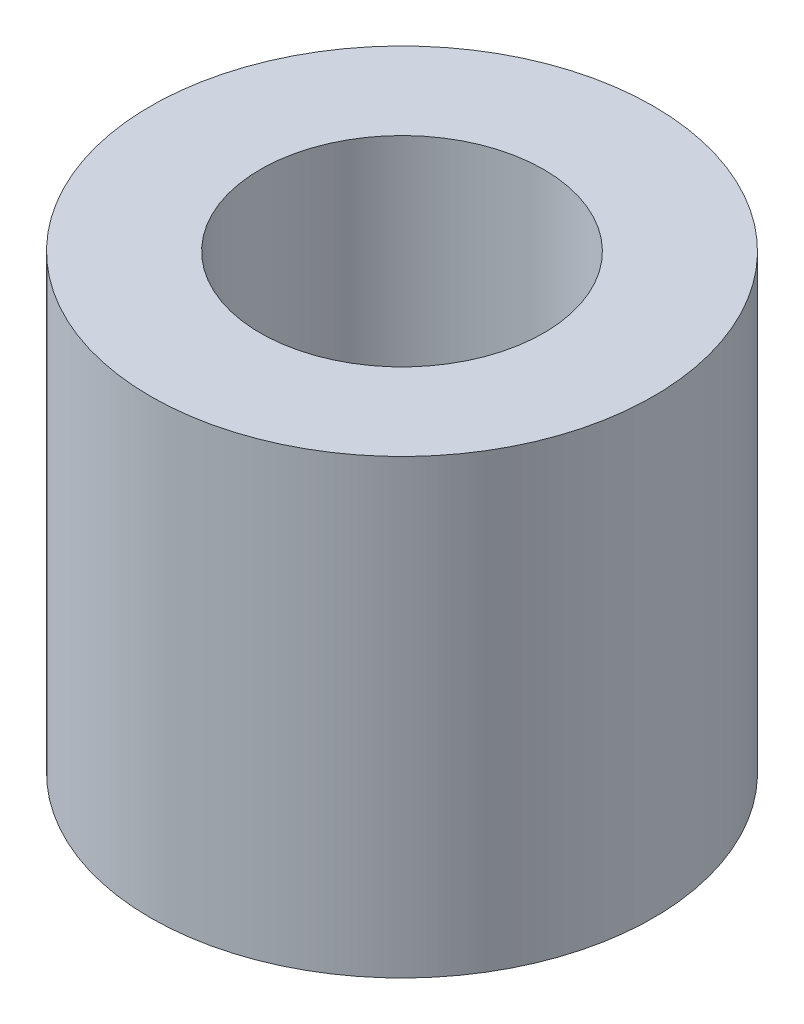
ISO-10303-21;
HEADER;
FILE_DESCRIPTION(('STEP AP214'),'2;1');
FILE_NAME('part.step','',(''),(''),'','','');
FILE_SCHEMA(('AUTOMOTIVE_DESIGN { 1 0 10303 214 1 1 1 1 }'));
ENDSEC;
DATA;
#1=APPLICATION_CONTEXT('core data for automotive mechanical design processes');
#2=APPLICATION_PROTOCOL_DEFINITION('international standard','automotive_design',2000,#1);
#3=PRODUCT_CONTEXT('',#1,'mechanical');
#4=PRODUCT('Part','Part','',(#3));
#5=PRODUCT_RELATED_PRODUCT_CATEGORY('part','',(#4));
#6=PRODUCT_DEFINITION_FORMATION('','',#4);
#7=PRODUCT_DEFINITION_CONTEXT('part definition',#1,'design');
#8=PRODUCT_DEFINITION('design','',#6,#7);
#9=PRODUCT_DEFINITION_SHAPE('','',#8);
#10=(LENGTH_UNIT() NAMED_UNIT(*) SI_UNIT(.MILLI.,.METRE.));
#11=(NAMED_UNIT(*) PLANE_ANGLE_UNIT() SI_UNIT($,.RADIAN.));
#12=(NAMED_UNIT(*) SI_UNIT($,.STERADIAN.) SOLID_ANGLE_UNIT());
#13=UNCERTAINTY_MEASURE_WITH_UNIT(LENGTH_MEASURE(1.E-05),#10,'distance_accuracy_value','');
#14=(GEOMETRIC_REPRESENTATION_CONTEXT(3) GLOBAL_UNCERTAINTY_ASSIGNED_CONTEXT((#13)) GLOBAL_UNIT_ASSIGNED_CONTEXT((#10,
#11,#12)) REPRESENTATION_CONTEXT('',''));
#15=CARTESIAN_POINT('',(0.,0.,0.));
#16=DIRECTION('',(0.,0.,1.));
#17=DIRECTION('',(1.,0.,0.));
#18=AXIS2_PLACEMENT_3D('',#15,#16,#17);
#19=CARTESIAN_POINT('',(0.,0.,0.));
#20=DIRECTION('',(0.,-1.,0.));
#21=DIRECTION('',(0.,0.,-1.));
#22=AXIS2_PLACEMENT_3D('',#19,#20,#21);
#23=CYLINDRICAL_SURFACE('',#22,3.175);
#24=CARTESIAN_POINT('',(0.,7.3914,0.));
#25=DIRECTION('',(0.,-1.,0.));
#26=DIRECTION('',(0.,0.,-1.));
#27=AXIS2_PLACEMENT_3D('',#24,#25,#26);
#28=CIRCLE('',#27,3.175);
#29=CARTESIAN_POINT('',(0.,7.3914,-3.175));
#30=VERTEX_POINT('',#29);
#31=EDGE_CURVE('E64',#30,#30,#28,.T.);
#32=ORIENTED_EDGE('',*,*,#31,.F.);
#33=EDGE_LOOP('',(#32));
#34=FACE_BOUND('',#33,.T.);
#35=CARTESIAN_POINT('',(0.,0.,0.));
#36=DIRECTION('',(0.,-1.,0.));
#37=DIRECTION('',(0.,0.,-1.));
#38=AXIS2_PLACEMENT_3D('',#35,#36,#37);
#39=CIRCLE('',#38,3.175);
#40=CARTESIAN_POINT('',(0.,0.,-3.175));
#41=VERTEX_POINT('',#40);
#42=EDGE_CURVE('E10',#41,#41,#39,.T.);
#43=ORIENTED_EDGE('',*,*,#42,.T.);
#44=EDGE_LOOP('',(#43));
#45=FACE_BOUND('',#44,.T.);
#46=ADVANCED_FACE('F37',(#34,#45),#23,.F.);
#47=CARTESIAN_POINT('',(-3.175,0.,0.));
#48=DIRECTION('',(0.,1.,0.));
#49=DIRECTION('',(0.,0.,1.));
#50=AXIS2_PLACEMENT_3D('',#47,#48,#49);
#51=PLANE('',#50);
#52=ORIENTED_EDGE('',*,*,#42,.F.);
#53=EDGE_LOOP('',(#52));
#54=FACE_BOUND('',#53,.T.);
#55=CARTESIAN_POINT('',(0.,0.,0.));
#56=DIRECTION('',(0.,-1.,0.));
#57=DIRECTION('',(0.,0.,-1.));
#58=AXIS2_PLACEMENT_3D('',#55,#56,#57);
#59=CIRCLE('',#58,20.7264);
#60=CARTESIAN_POINT('',(0.,0.,-20.7264));
#61=VERTEX_POINT('',#60);
#62=EDGE_CURVE('E44',#61,#61,#59,.T.);
#63=ORIENTED_EDGE('',*,*,#62,.T.);
#64=EDGE_LOOP('',(#63));
#65=FACE_BOUND('',#64,.T.);
#66=ADVANCED_FACE('F72',(#54,#65),#51,.F.);
#67=CARTESIAN_POINT('',(0.,0.,0.));
#68=DIRECTION('',(0.,-1.,0.));
#69=DIRECTION('',(0.,0.,-1.));
#70=AXIS2_PLACEMENT_3D('',#67,#68,#69);
#71=CYLINDRICAL_SURFACE('',#70,20.7264);
#72=ORIENTED_EDGE('',*,*,#62,.F.);
#73=EDGE_LOOP('',(#72));
#74=FACE_BOUND('',#73,.T.);
#75=CARTESIAN_POINT('',(0.,37.2364,0.));
#76=DIRECTION('',(0.,-1.,0.));
#77=DIRECTION('',(0.,0.,-1.));
#78=AXIS2_PLACEMENT_3D('',#75,#76,#77);
#79=CIRCLE('',#78,20.7264);
#80=CARTESIAN_POINT('',(0.,37.2364,-20.7264));
#81=VERTEX_POINT('',#80);
#82=EDGE_CURVE('E49',#81,#81,#79,.T.);
#83=ORIENTED_EDGE('',*,*,#82,.T.);
#84=EDGE_LOOP('',(#83));
#85=FACE_BOUND('',#84,.T.);
#86=ADVANCED_FACE('F76',(#74,#85),#71,.T.);
#87=CARTESIAN_POINT('',(-20.7264,37.2364,0.));
#88=DIRECTION('',(0.,-1.,0.));
#89=DIRECTION('',(0.,0.,-1.));
#90=AXIS2_PLACEMENT_3D('',#87,#88,#89);
#91=PLANE('',#90);
#92=ORIENTED_EDGE('',*,*,#82,.F.);
#93=EDGE_LOOP('',(#92));
#94=FACE_BOUND('',#93,.T.);
#95=CARTESIAN_POINT('',(0.,37.2364,0.));
#96=DIRECTION('',(0.,-1.,0.));
#97=DIRECTION('',(0.,0.,-1.));
#98=AXIS2_PLACEMENT_3D('',#95,#96,#97);
#99=CIRCLE('',#98,11.684);
#100=CARTESIAN_POINT('',(0.,37.2364,-11.684));
#101=VERTEX_POINT('',#100);
#102=EDGE_CURVE('E54',#101,#101,#99,.T.);
#103=ORIENTED_EDGE('',*,*,#102,.T.);
#104=EDGE_LOOP('',(#103));
#105=FACE_BOUND('',#104,.T.);
#106=ADVANCED_FACE('F81',(#94,#105),#91,.F.);
#107=CARTESIAN_POINT('',(0.,0.,0.));
#108=DIRECTION('',(0.,-1.,0.));
#109=DIRECTION('',(0.,0.,-1.));
#110=AXIS2_PLACEMENT_3D('',#107,#108,#109);
#111=CYLINDRICAL_SURFACE('',#110,11.684);
#112=ORIENTED_EDGE('',*,*,#102,.F.);
#113=EDGE_LOOP('',(#112));
#114=FACE_BOUND('',#113,.T.);
#115=CARTESIAN_POINT('',(0.,7.3914,0.));
#116=DIRECTION('',(0.,-1.,0.));
#117=DIRECTION('',(0.,0.,-1.));
#118=AXIS2_PLACEMENT_3D('',#115,#116,#117);
#119=CIRCLE('',#118,11.684);
#120=CARTESIAN_POINT('',(0.,7.3914,-11.684));
#121=VERTEX_POINT('',#120);
#122=EDGE_CURVE('E60',#121,#121,#119,.T.);
#123=ORIENTED_EDGE('',*,*,#122,.T.);
#124=EDGE_LOOP('',(#123));
#125=FACE_BOUND('',#124,.T.);
#126=ADVANCED_FACE('F87',(#114,#125),#111,.F.);
#127=CARTESIAN_POINT('',(-11.684,7.3914,0.));
#128=DIRECTION('',(0.,-1.,0.));
#129=DIRECTION('',(0.,0.,-1.));
#130=AXIS2_PLACEMENT_3D('',#127,#128,#129);
#131=PLANE('',#130);
#132=ORIENTED_EDGE('',*,*,#122,.F.);
#133=EDGE_LOOP('',(#132));
#134=FACE_BOUND('',#133,.T.);
#135=ORIENTED_EDGE('',*,*,#31,.T.);
#136=EDGE_LOOP('',(#135));
#137=FACE_BOUND('',#136,.T.);
#138=ADVANCED_FACE('F69',(#134,#137),#131,.F.);
#139=CLOSED_SHELL('',(#46,#66,#86,#106,#126,#138));
#140=MANIFOLD_SOLID_BREP('B2',#139);
#141=ADVANCED_BREP_SHAPE_REPRESENTATION('',(#18,#140),#14);
#142=SHAPE_DEFINITION_REPRESENTATION(#9,#141);
ENDSEC;
END-ISO-10303-21;
